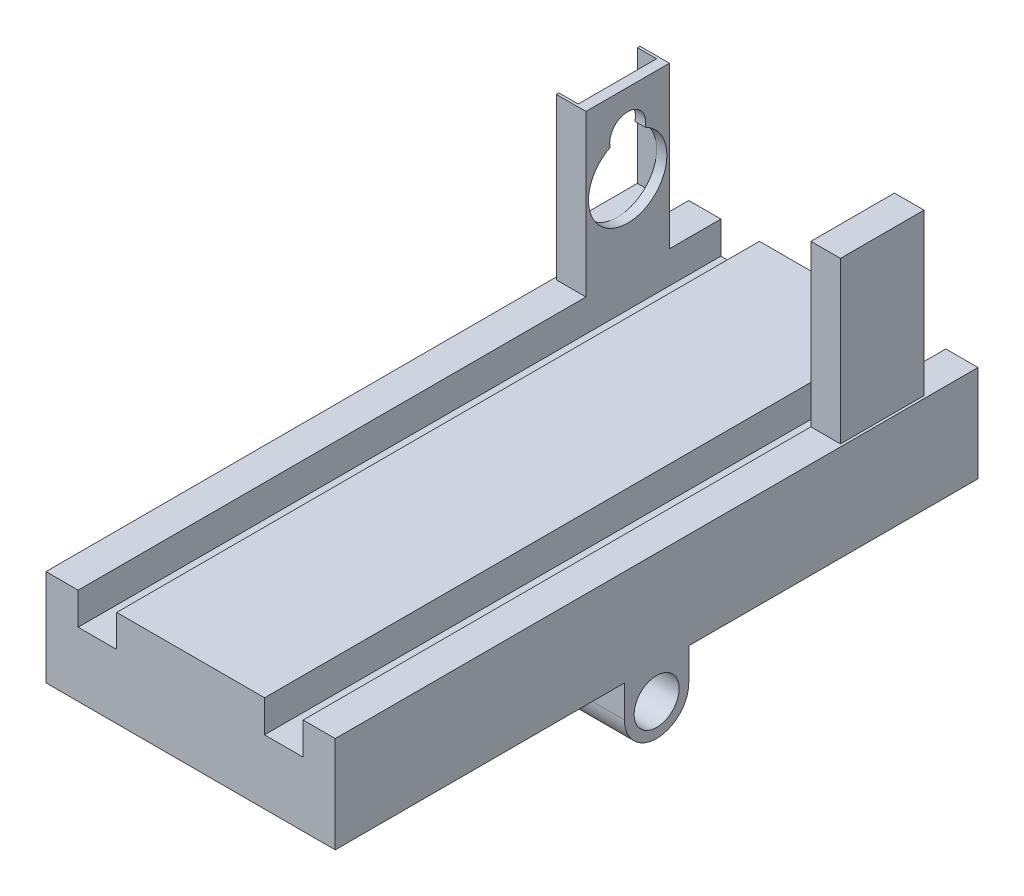
ISO-10303-21;
HEADER;
FILE_DESCRIPTION(('STEP AP214'),'2;1');
FILE_NAME('part.step','',(''),(''),'','','');
FILE_SCHEMA(('AUTOMOTIVE_DESIGN { 1 0 10303 214 1 1 1 1 }'));
ENDSEC;
DATA;
#1=APPLICATION_CONTEXT('core data for automotive mechanical design processes');
#2=APPLICATION_PROTOCOL_DEFINITION('international standard','automotive_design',2000,#1);
#3=PRODUCT_CONTEXT('',#1,'mechanical');
#4=PRODUCT('Part','Part','',(#3));
#5=PRODUCT_RELATED_PRODUCT_CATEGORY('part','',(#4));
#6=PRODUCT_DEFINITION_FORMATION('','',#4);
#7=PRODUCT_DEFINITION_CONTEXT('part definition',#1,'design');
#8=PRODUCT_DEFINITION('design','',#6,#7);
#9=PRODUCT_DEFINITION_SHAPE('','',#8);
#10=(LENGTH_UNIT() NAMED_UNIT(*) SI_UNIT(.MILLI.,.METRE.));
#11=(NAMED_UNIT(*) PLANE_ANGLE_UNIT() SI_UNIT($,.RADIAN.));
#12=(NAMED_UNIT(*) SI_UNIT($,.STERADIAN.) SOLID_ANGLE_UNIT());
#13=UNCERTAINTY_MEASURE_WITH_UNIT(LENGTH_MEASURE(1.E-05),#10,'distance_accuracy_value','');
#14=(GEOMETRIC_REPRESENTATION_CONTEXT(3) GLOBAL_UNCERTAINTY_ASSIGNED_CONTEXT((#13)) GLOBAL_UNIT_ASSIGNED_CONTEXT((#10,
#11,#12)) REPRESENTATION_CONTEXT('',''));
#15=CARTESIAN_POINT('',(0.,0.,0.));
#16=DIRECTION('',(0.,0.,1.));
#17=DIRECTION('',(1.,0.,0.));
#18=AXIS2_PLACEMENT_3D('',#15,#16,#17);
#19=CARTESIAN_POINT('',(-42.5,23.9,14.5));
#20=DIRECTION('',(1.,0.,0.));
#21=DIRECTION('',(0.,0.,-1.));
#22=AXIS2_PLACEMENT_3D('',#19,#20,#21);
#23=CYLINDRICAL_SURFACE('',#22,2.8);
#24=CARTESIAN_POINT('',(-19.1,23.9,14.5));
#25=DIRECTION('',(-1.,0.,0.));
#26=DIRECTION('',(0.,-1.,0.));
#27=AXIS2_PLACEMENT_3D('',#24,#25,#26);
#28=CIRCLE('',#27,2.8);
#29=CARTESIAN_POINT('',(-19.1,23.2573770491803,11.7747411603519));
#30=VERTEX_POINT('',#29);
#31=CARTESIAN_POINT('',(-19.1,23.2573770491803,17.225258839648));
#32=VERTEX_POINT('',#31);
#33=EDGE_CURVE('E302',#30,#32,#28,.F.);
#34=ORIENTED_EDGE('',*,*,#33,.F.);
#35=DIRECTION('',(1.,0.,0.));
#36=VECTOR('',#35,1.);
#37=CARTESIAN_POINT('',(-30.,23.2573770491803,11.7747411603519));
#38=LINE('',#37,#36);
#39=CARTESIAN_POINT('',(-17.5,23.2573770491803,11.7747411603519));
#40=VERTEX_POINT('',#39);
#41=EDGE_CURVE('E327',#30,#40,#38,.T.);
#42=ORIENTED_EDGE('',*,*,#41,.T.);
#43=CARTESIAN_POINT('',(-17.5,23.9,14.5));
#44=DIRECTION('',(1.,0.,0.));
#45=DIRECTION('',(0.,0.,-1.));
#46=AXIS2_PLACEMENT_3D('',#43,#44,#45);
#47=CIRCLE('',#46,2.8);
#48=CARTESIAN_POINT('',(-17.5,23.2573770491803,17.225258839648));
#49=VERTEX_POINT('',#48);
#50=EDGE_CURVE('E317',#40,#49,#47,.T.);
#51=ORIENTED_EDGE('',*,*,#50,.T.);
#52=DIRECTION('',(1.,0.,0.));
#53=VECTOR('',#52,1.);
#54=CARTESIAN_POINT('',(-30.,23.2573770491803,17.225258839648));
#55=LINE('',#54,#53);
#56=EDGE_CURVE('E320',#49,#32,#55,.F.);
#57=ORIENTED_EDGE('',*,*,#56,.T.);
#58=EDGE_LOOP('',(#34,#42,#51,#57));
#59=FACE_BOUND('',#58,.T.);
#60=ADVANCED_FACE('F51',(#59),#23,.F.);
#61=CARTESIAN_POINT('',(-42.5,17.8,14.5));
#62=DIRECTION('',(1.,0.,0.));
#63=DIRECTION('',(0.,0.,-1.));
#64=AXIS2_PLACEMENT_3D('',#61,#62,#63);
#65=CYLINDRICAL_SURFACE('',#64,6.1);
#66=CARTESIAN_POINT('',(-19.1,17.8,14.5));
#67=DIRECTION('',(-1.,0.,0.));
#68=DIRECTION('',(0.,-1.,0.));
#69=AXIS2_PLACEMENT_3D('',#66,#67,#68);
#70=CIRCLE('',#69,6.1);
#71=CARTESIAN_POINT('',(-19.1,17.8,8.4));
#72=VERTEX_POINT('',#71);
#73=EDGE_CURVE('E12',#72,#30,#70,.F.);
#74=ORIENTED_EDGE('',*,*,#73,.F.);
#75=CARTESIAN_POINT('',(-19.1,11.7,14.5));
#76=VERTEX_POINT('',#75);
#77=EDGE_CURVE('E61',#76,#72,#70,.F.);
#78=ORIENTED_EDGE('',*,*,#77,.F.);
#79=CARTESIAN_POINT('',(-19.1,17.8,20.6));
#80=VERTEX_POINT('',#79);
#81=EDGE_CURVE('E55',#80,#76,#70,.F.);
#82=ORIENTED_EDGE('',*,*,#81,.F.);
#83=EDGE_CURVE('E583',#32,#80,#70,.F.);
#84=ORIENTED_EDGE('',*,*,#83,.F.);
#85=ORIENTED_EDGE('',*,*,#56,.F.);
#86=CARTESIAN_POINT('',(-17.5,17.8,14.5));
#87=DIRECTION('',(1.,0.,0.));
#88=DIRECTION('',(0.,0.,-1.));
#89=AXIS2_PLACEMENT_3D('',#86,#87,#88);
#90=CIRCLE('',#89,6.1);
#91=EDGE_CURVE('E316',#49,#40,#90,.T.);
#92=ORIENTED_EDGE('',*,*,#91,.T.);
#93=ORIENTED_EDGE('',*,*,#41,.F.);
#94=EDGE_LOOP('',(#74,#78,#82,#84,#85,#92,#93));
#95=FACE_BOUND('',#94,.T.);
#96=ADVANCED_FACE('F593',(#95),#65,.F.);
#97=CARTESIAN_POINT('',(-17.5,5.,100.));
#98=DIRECTION('',(0.,-1.,0.));
#99=DIRECTION('',(1.,0.,0.));
#100=AXIS2_PLACEMENT_3D('',#97,#98,#99);
#101=PLANE('',#100);
#102=DIRECTION('',(1.,0.,0.));
#103=VECTOR('',#102,1.);
#104=CARTESIAN_POINT('',(-22.1,5.,21.));
#105=LINE('',#104,#103);
#106=CARTESIAN_POINT('',(-22.1,5.,21.));
#107=VERTEX_POINT('',#106);
#108=CARTESIAN_POINT('',(-17.5,5.,21.));
#109=VERTEX_POINT('',#108);
#110=EDGE_CURVE('E350',#107,#109,#105,.T.);
#111=ORIENTED_EDGE('',*,*,#110,.F.);
#112=DIRECTION('',(0.,0.,1.));
#113=VECTOR('',#112,1.);
#114=CARTESIAN_POINT('',(-22.1,5.,8.));
#115=LINE('',#114,#113);
#116=CARTESIAN_POINT('',(-22.1,5.,8.));
#117=VERTEX_POINT('',#116);
#118=EDGE_CURVE('E346',#117,#107,#115,.T.);
#119=ORIENTED_EDGE('',*,*,#118,.F.);
#120=DIRECTION('',(-1.,0.,0.));
#121=VECTOR('',#120,1.);
#122=CARTESIAN_POINT('',(-22.1,5.,8.));
#123=LINE('',#122,#121);
#124=CARTESIAN_POINT('',(-17.5,5.,8.00000000000001));
#125=VERTEX_POINT('',#124);
#126=EDGE_CURVE('E355',#125,#117,#123,.T.);
#127=ORIENTED_EDGE('',*,*,#126,.F.);
#128=DIRECTION('',(0.,0.,-1.));
#129=VECTOR('',#128,1.);
#130=CARTESIAN_POINT('',(-17.5,5.,100.));
#131=LINE('',#130,#129);
#132=CARTESIAN_POINT('',(-17.5,5.,0.));
#133=VERTEX_POINT('',#132);
#134=EDGE_CURVE('E570',#125,#133,#131,.T.);
#135=ORIENTED_EDGE('',*,*,#134,.T.);
#136=DIRECTION('',(-1.,0.,0.));
#137=VECTOR('',#136,1.);
#138=CARTESIAN_POINT('',(-17.5,5.,0.));
#139=LINE('',#138,#137);
#140=CARTESIAN_POINT('',(-22.5,5.,0.));
#141=VERTEX_POINT('',#140);
#142=EDGE_CURVE('E503',#133,#141,#139,.T.);
#143=ORIENTED_EDGE('',*,*,#142,.T.);
#144=DIRECTION('',(0.,0.,-1.));
#145=VECTOR('',#144,1.);
#146=CARTESIAN_POINT('',(-22.5,5.,100.));
#147=LINE('',#146,#145);
#148=CARTESIAN_POINT('',(-22.5,5.,100.));
#149=VERTEX_POINT('',#148);
#150=EDGE_CURVE('E566',#149,#141,#147,.T.);
#151=ORIENTED_EDGE('',*,*,#150,.F.);
#152=DIRECTION('',(-1.,0.,0.));
#153=VECTOR('',#152,1.);
#154=CARTESIAN_POINT('',(-17.5,5.,100.));
#155=LINE('',#154,#153);
#156=CARTESIAN_POINT('',(-17.5,5.,100.));
#157=VERTEX_POINT('',#156);
#158=EDGE_CURVE('E465',#157,#149,#155,.T.);
#159=ORIENTED_EDGE('',*,*,#158,.F.);
#160=EDGE_CURVE('E571',#157,#109,#131,.T.);
#161=ORIENTED_EDGE('',*,*,#160,.T.);
#162=EDGE_LOOP('',(#111,#119,#127,#135,#143,#151,#159,#161));
#163=FACE_BOUND('',#162,.T.);
#164=ADVANCED_FACE('F618',(#163),#101,.F.);
#165=CARTESIAN_POINT('',(22.5,5.,100.));
#166=DIRECTION('',(0.,-1.,0.));
#167=DIRECTION('',(1.,0.,0.));
#168=AXIS2_PLACEMENT_3D('',#165,#166,#167);
#169=PLANE('',#168);
#170=DIRECTION('',(1.,0.,0.));
#171=VECTOR('',#170,1.);
#172=CARTESIAN_POINT('',(17.5,4.99999999999999,21.));
#173=LINE('',#172,#171);
#174=CARTESIAN_POINT('',(17.5,4.99999999999999,21.));
#175=VERTEX_POINT('',#174);
#176=CARTESIAN_POINT('',(22.1,4.99999999999999,21.));
#177=VERTEX_POINT('',#176);
#178=EDGE_CURVE('E351',#175,#177,#173,.T.);
#179=ORIENTED_EDGE('',*,*,#178,.F.);
#180=DIRECTION('',(0.,0.,-1.));
#181=VECTOR('',#180,1.);
#182=CARTESIAN_POINT('',(17.5,5.,100.));
#183=LINE('',#182,#181);
#184=CARTESIAN_POINT('',(17.5,5.,100.));
#185=VERTEX_POINT('',#184);
#186=EDGE_CURVE('E548',#185,#175,#183,.T.);
#187=ORIENTED_EDGE('',*,*,#186,.F.);
#188=DIRECTION('',(-1.,0.,0.));
#189=VECTOR('',#188,1.);
#190=CARTESIAN_POINT('',(22.5,5.,100.));
#191=LINE('',#190,#189);
#192=CARTESIAN_POINT('',(22.5,5.,100.));
#193=VERTEX_POINT('',#192);
#194=EDGE_CURVE('E477',#193,#185,#191,.T.);
#195=ORIENTED_EDGE('',*,*,#194,.F.);
#196=DIRECTION('',(0.,0.,-1.));
#197=VECTOR('',#196,1.);
#198=CARTESIAN_POINT('',(22.5,5.,100.));
#199=LINE('',#198,#197);
#200=CARTESIAN_POINT('',(22.5,5.,0.));
#201=VERTEX_POINT('',#200);
#202=EDGE_CURVE('E552',#193,#201,#199,.T.);
#203=ORIENTED_EDGE('',*,*,#202,.T.);
#204=DIRECTION('',(-1.,0.,0.));
#205=VECTOR('',#204,1.);
#206=CARTESIAN_POINT('',(22.5,5.,0.));
#207=LINE('',#206,#205);
#208=CARTESIAN_POINT('',(17.5,5.,0.));
#209=VERTEX_POINT('',#208);
#210=EDGE_CURVE('E517',#201,#209,#207,.T.);
#211=ORIENTED_EDGE('',*,*,#210,.T.);
#212=CARTESIAN_POINT('',(17.5,5.,8.00000000000001));
#213=VERTEX_POINT('',#212);
#214=EDGE_CURVE('E547',#213,#209,#183,.T.);
#215=ORIENTED_EDGE('',*,*,#214,.F.);
#216=DIRECTION('',(-1.,0.,0.));
#217=VECTOR('',#216,1.);
#218=CARTESIAN_POINT('',(17.5,4.99999999999999,8.00000000000001));
#219=LINE('',#218,#217);
#220=CARTESIAN_POINT('',(22.1,4.99999999999999,8.));
#221=VERTEX_POINT('',#220);
#222=EDGE_CURVE('E389',#221,#213,#219,.T.);
#223=ORIENTED_EDGE('',*,*,#222,.F.);
#224=DIRECTION('',(0.,0.,-1.));
#225=VECTOR('',#224,1.);
#226=CARTESIAN_POINT('',(22.1,4.99999999999999,8.));
#227=LINE('',#226,#225);
#228=EDGE_CURVE('E393',#177,#221,#227,.T.);
#229=ORIENTED_EDGE('',*,*,#228,.F.);
#230=EDGE_LOOP('',(#179,#187,#195,#203,#211,#215,#223,#229));
#231=FACE_BOUND('',#230,.T.);
#232=ADVANCED_FACE('F727',(#231),#169,.F.);
#233=CARTESIAN_POINT('',(-22.5,-10.,100.));
#234=DIRECTION('',(0.,1.,0.));
#235=DIRECTION('',(0.,0.,1.));
#236=AXIS2_PLACEMENT_3D('',#233,#234,#235);
#237=PLANE('',#236);
#238=DIRECTION('',(-1.,0.,0.));
#239=VECTOR('',#238,1.);
#240=CARTESIAN_POINT('',(22.5,-10.,55.));
#241=LINE('',#240,#239);
#242=CARTESIAN_POINT('',(22.5,-10.,55.));
#243=VERTEX_POINT('',#242);
#244=CARTESIAN_POINT('',(-22.5,-10.,55.));
#245=VERTEX_POINT('',#244);
#246=EDGE_CURVE('E448',#243,#245,#241,.T.);
#247=ORIENTED_EDGE('',*,*,#246,.F.);
#248=DIRECTION('',(0.,0.,-1.));
#249=VECTOR('',#248,1.);
#250=CARTESIAN_POINT('',(22.5,-10.,100.));
#251=LINE('',#250,#249);
#252=CARTESIAN_POINT('',(22.5,-10.,100.));
#253=VERTEX_POINT('',#252);
#254=EDGE_CURVE('E557',#253,#243,#251,.T.);
#255=ORIENTED_EDGE('',*,*,#254,.F.);
#256=DIRECTION('',(1.,0.,0.));
#257=VECTOR('',#256,1.);
#258=CARTESIAN_POINT('',(-22.5,-10.,100.));
#259=LINE('',#258,#257);
#260=CARTESIAN_POINT('',(-22.5,-10.,100.));
#261=VERTEX_POINT('',#260);
#262=EDGE_CURVE('E471',#261,#253,#259,.T.);
#263=ORIENTED_EDGE('',*,*,#262,.F.);
#264=DIRECTION('',(0.,0.,-1.));
#265=VECTOR('',#264,1.);
#266=CARTESIAN_POINT('',(-22.5,-10.,100.));
#267=LINE('',#266,#265);
#268=EDGE_CURVE('E562',#261,#245,#267,.T.);
#269=ORIENTED_EDGE('',*,*,#268,.T.);
#270=EDGE_LOOP('',(#247,#255,#263,#269));
#271=FACE_BOUND('',#270,.T.);
#272=ADVANCED_FACE('F730',(#271),#237,.F.);
#273=CARTESIAN_POINT('',(-11.5,5.,100.));
#274=DIRECTION('',(1.,0.,0.));
#275=DIRECTION('',(0.,0.,-1.));
#276=AXIS2_PLACEMENT_3D('',#273,#274,#275);
#277=PLANE('',#276);
#278=DIRECTION('',(0.,-1.,0.));
#279=VECTOR('',#278,1.);
#280=CARTESIAN_POINT('',(-11.5,5.,0.));
#281=LINE('',#280,#279);
#282=CARTESIAN_POINT('',(-11.5,5.,0.));
#283=VERTEX_POINT('',#282);
#284=CARTESIAN_POINT('',(-11.5,0.,0.));
#285=VERTEX_POINT('',#284);
#286=EDGE_CURVE('E443',#283,#285,#281,.T.);
#287=ORIENTED_EDGE('',*,*,#286,.T.);
#288=DIRECTION('',(0.,0.,-1.));
#289=VECTOR('',#288,1.);
#290=CARTESIAN_POINT('',(-11.5,0.,100.));
#291=LINE('',#290,#289);
#292=CARTESIAN_POINT('',(-11.5,0.,100.));
#293=VERTEX_POINT('',#292);
#294=EDGE_CURVE('E577',#293,#285,#291,.T.);
#295=ORIENTED_EDGE('',*,*,#294,.F.);
#296=DIRECTION('',(0.,-1.,0.));
#297=VECTOR('',#296,1.);
#298=CARTESIAN_POINT('',(-11.5,5.,100.));
#299=LINE('',#298,#297);
#300=CARTESIAN_POINT('',(-11.5,5.,100.));
#301=VERTEX_POINT('',#300);
#302=EDGE_CURVE('E454',#301,#293,#299,.T.);
#303=ORIENTED_EDGE('',*,*,#302,.F.);
#304=DIRECTION('',(0.,0.,-1.));
#305=VECTOR('',#304,1.);
#306=CARTESIAN_POINT('',(-11.5,5.,100.));
#307=LINE('',#306,#305);
#308=EDGE_CURVE('E492',#301,#283,#307,.T.);
#309=ORIENTED_EDGE('',*,*,#308,.T.);
#310=EDGE_LOOP('',(#287,#295,#303,#309));
#311=FACE_BOUND('',#310,.T.);
#312=ADVANCED_FACE('F53',(#311),#277,.F.);
#313=CARTESIAN_POINT('',(-11.5,0.,100.));
#314=DIRECTION('',(0.,-1.,0.));
#315=DIRECTION('',(1.,0.,0.));
#316=AXIS2_PLACEMENT_3D('',#313,#314,#315);
#317=PLANE('',#316);
#318=DIRECTION('',(-1.,0.,0.));
#319=VECTOR('',#318,1.);
#320=CARTESIAN_POINT('',(-11.5,0.,0.));
#321=LINE('',#320,#319);
#322=CARTESIAN_POINT('',(-17.5,0.,0.));
#323=VERTEX_POINT('',#322);
#324=EDGE_CURVE('E496',#285,#323,#321,.T.);
#325=ORIENTED_EDGE('',*,*,#324,.T.);
#326=DIRECTION('',(0.,0.,-1.));
#327=VECTOR('',#326,1.);
#328=CARTESIAN_POINT('',(-17.5,0.,100.));
#329=LINE('',#328,#327);
#330=CARTESIAN_POINT('',(-17.5,0.,100.));
#331=VERTEX_POINT('',#330);
#332=EDGE_CURVE('E574',#331,#323,#329,.T.);
#333=ORIENTED_EDGE('',*,*,#332,.F.);
#334=DIRECTION('',(-1.,0.,0.));
#335=VECTOR('',#334,1.);
#336=CARTESIAN_POINT('',(-11.5,0.,100.));
#337=LINE('',#336,#335);
#338=EDGE_CURVE('E458',#293,#331,#337,.T.);
#339=ORIENTED_EDGE('',*,*,#338,.F.);
#340=ORIENTED_EDGE('',*,*,#294,.T.);
#341=EDGE_LOOP('',(#325,#333,#339,#340));
#342=FACE_BOUND('',#341,.T.);
#343=ADVANCED_FACE('F603',(#342),#317,.F.);
#344=CARTESIAN_POINT('',(-17.5,0.,100.));
#345=DIRECTION('',(-1.,0.,0.));
#346=DIRECTION('',(0.,0.,1.));
#347=AXIS2_PLACEMENT_3D('',#344,#345,#346);
#348=PLANE('',#347);
#349=ORIENTED_EDGE('',*,*,#91,.F.);
#350=ORIENTED_EDGE('',*,*,#50,.F.);
#351=EDGE_LOOP('',(#349,#350));
#352=FACE_BOUND('',#351,.T.);
#353=DIRECTION('',(0.,1.,0.));
#354=VECTOR('',#353,1.);
#355=CARTESIAN_POINT('',(-17.5,0.,0.));
#356=LINE('',#355,#354);
#357=EDGE_CURVE('E499',#323,#133,#356,.T.);
#358=ORIENTED_EDGE('',*,*,#357,.T.);
#359=ORIENTED_EDGE('',*,*,#134,.F.);
#360=DIRECTION('',(0.,-1.,0.));
#361=VECTOR('',#360,1.);
#362=CARTESIAN_POINT('',(-17.5,30.,8.));
#363=LINE('',#362,#361);
#364=CARTESIAN_POINT('',(-17.5,30.,8.));
#365=VERTEX_POINT('',#364);
#366=EDGE_CURVE('E362',#365,#125,#363,.T.);
#367=ORIENTED_EDGE('',*,*,#366,.F.);
#368=DIRECTION('',(0.,0.,-1.));
#369=VECTOR('',#368,1.);
#370=CARTESIAN_POINT('',(-17.5,30.,8.));
#371=LINE('',#370,#369);
#372=CARTESIAN_POINT('',(-17.5,30.,21.));
#373=VERTEX_POINT('',#372);
#374=EDGE_CURVE('E339',#373,#365,#371,.T.);
#375=ORIENTED_EDGE('',*,*,#374,.F.);
#376=DIRECTION('',(0.,-1.,0.));
#377=VECTOR('',#376,1.);
#378=CARTESIAN_POINT('',(-17.5,30.,21.));
#379=LINE('',#378,#377);
#380=EDGE_CURVE('E366',#373,#109,#379,.T.);
#381=ORIENTED_EDGE('',*,*,#380,.T.);
#382=ORIENTED_EDGE('',*,*,#160,.F.);
#383=DIRECTION('',(0.,1.,0.));
#384=VECTOR('',#383,1.);
#385=CARTESIAN_POINT('',(-17.5,0.,100.));
#386=LINE('',#385,#384);
#387=EDGE_CURVE('E462',#331,#157,#386,.T.);
#388=ORIENTED_EDGE('',*,*,#387,.F.);
#389=ORIENTED_EDGE('',*,*,#332,.T.);
#390=EDGE_LOOP('',(#358,#359,#367,#375,#381,#382,#388,#389));
#391=FACE_BOUND('',#390,.T.);
#392=ADVANCED_FACE('F599',(#352,#391),#348,.F.);
#393=CARTESIAN_POINT('',(-22.5,5.,100.));
#394=DIRECTION('',(1.,0.,0.));
#395=DIRECTION('',(0.,0.,-1.));
#396=AXIS2_PLACEMENT_3D('',#393,#394,#395);
#397=PLANE('',#396);
#398=CARTESIAN_POINT('',(-22.5,-15.,50.));
#399=DIRECTION('',(-1.,0.,0.));
#400=DIRECTION('',(0.,0.,1.));
#401=AXIS2_PLACEMENT_3D('',#398,#399,#400);
#402=CIRCLE('',#401,3.5);
#403=CARTESIAN_POINT('',(-22.5,-15.,53.5));
#404=VERTEX_POINT('',#403);
#405=EDGE_CURVE('E374',#404,#404,#402,.T.);
#406=ORIENTED_EDGE('',*,*,#405,.F.);
#407=EDGE_LOOP('',(#406));
#408=FACE_BOUND('',#407,.T.);
#409=DIRECTION('',(0.,-1.,0.));
#410=VECTOR('',#409,1.);
#411=CARTESIAN_POINT('',(-22.5,-15.,45.));
#412=LINE('',#411,#410);
#413=CARTESIAN_POINT('',(-22.5,-10.,45.));
#414=VERTEX_POINT('',#413);
#415=CARTESIAN_POINT('',(-22.5,-15.,45.));
#416=VERTEX_POINT('',#415);
#417=EDGE_CURVE('E430',#414,#416,#412,.T.);
#418=ORIENTED_EDGE('',*,*,#417,.T.);
#419=CARTESIAN_POINT('',(-22.5,-15.,50.));
#420=DIRECTION('',(-1.,0.,0.));
#421=DIRECTION('',(0.,0.,1.));
#422=AXIS2_PLACEMENT_3D('',#419,#420,#421);
#423=CIRCLE('',#422,5.);
#424=CARTESIAN_POINT('',(-22.5,-15.,55.));
#425=VERTEX_POINT('',#424);
#426=EDGE_CURVE('E414',#416,#425,#423,.T.);
#427=ORIENTED_EDGE('',*,*,#426,.T.);
#428=DIRECTION('',(0.,1.,0.));
#429=VECTOR('',#428,1.);
#430=CARTESIAN_POINT('',(-22.5,-15.,55.));
#431=LINE('',#430,#429);
#432=EDGE_CURVE('E422',#425,#245,#431,.T.);
#433=ORIENTED_EDGE('',*,*,#432,.T.);
#434=ORIENTED_EDGE('',*,*,#268,.F.);
#435=DIRECTION('',(0.,-1.,0.));
#436=VECTOR('',#435,1.);
#437=CARTESIAN_POINT('',(-22.5,5.,100.));
#438=LINE('',#437,#436);
#439=EDGE_CURVE('E468',#149,#261,#438,.T.);
#440=ORIENTED_EDGE('',*,*,#439,.F.);
#441=ORIENTED_EDGE('',*,*,#150,.T.);
#442=DIRECTION('',(0.,-1.,0.));
#443=VECTOR('',#442,1.);
#444=CARTESIAN_POINT('',(-22.5,5.,0.));
#445=LINE('',#444,#443);
#446=CARTESIAN_POINT('',(-22.5,-10.,0.));
#447=VERTEX_POINT('',#446);
#448=EDGE_CURVE('E506',#141,#447,#445,.T.);
#449=ORIENTED_EDGE('',*,*,#448,.T.);
#450=EDGE_CURVE('E561',#414,#447,#267,.T.);
#451=ORIENTED_EDGE('',*,*,#450,.F.);
#452=EDGE_LOOP('',(#418,#427,#433,#434,#440,#441,#449,#451));
#453=FACE_BOUND('',#452,.T.);
#454=ADVANCED_FACE('F602',(#408,#453),#397,.F.);
#455=CARTESIAN_POINT('',(22.5,-10.,45.));
#456=VERTEX_POINT('',#455);
#457=CARTESIAN_POINT('',(22.5,-10.,0.));
#458=VERTEX_POINT('',#457);
#459=EDGE_CURVE('E556',#456,#458,#251,.T.);
#460=ORIENTED_EDGE('',*,*,#459,.F.);
#461=DIRECTION('',(-1.,0.,0.));
#462=VECTOR('',#461,1.);
#463=CARTESIAN_POINT('',(22.5,-10.,45.));
#464=LINE('',#463,#462);
#465=EDGE_CURVE('E444',#456,#414,#464,.T.);
#466=ORIENTED_EDGE('',*,*,#465,.T.);
#467=ORIENTED_EDGE('',*,*,#450,.T.);
#468=DIRECTION('',(1.,0.,0.));
#469=VECTOR('',#468,1.);
#470=CARTESIAN_POINT('',(-22.5,-10.,0.));
#471=LINE('',#470,#469);
#472=EDGE_CURVE('E510',#447,#458,#471,.T.);
#473=ORIENTED_EDGE('',*,*,#472,.T.);
#474=EDGE_LOOP('',(#460,#466,#467,#473));
#475=FACE_BOUND('',#474,.T.);
#476=ADVANCED_FACE('F734',(#475),#237,.F.);
#477=CARTESIAN_POINT('',(22.5,-10.,100.));
#478=DIRECTION('',(-1.,0.,0.));
#479=DIRECTION('',(0.,-1.,0.));
#480=AXIS2_PLACEMENT_3D('',#477,#478,#479);
#481=PLANE('',#480);
#482=CARTESIAN_POINT('',(22.5,-15.,50.));
#483=DIRECTION('',(-1.,0.,0.));
#484=DIRECTION('',(0.,0.,1.));
#485=AXIS2_PLACEMENT_3D('',#482,#483,#484);
#486=CIRCLE('',#485,3.5);
#487=CARTESIAN_POINT('',(22.5,-15.,53.5));
#488=VERTEX_POINT('',#487);
#489=EDGE_CURVE('E410',#488,#488,#486,.T.);
#490=ORIENTED_EDGE('',*,*,#489,.T.);
#491=EDGE_LOOP('',(#490));
#492=FACE_BOUND('',#491,.T.);
#493=DIRECTION('',(0.,1.,0.));
#494=VECTOR('',#493,1.);
#495=CARTESIAN_POINT('',(22.5,-15.,55.));
#496=LINE('',#495,#494);
#497=CARTESIAN_POINT('',(22.5,-15.,55.));
#498=VERTEX_POINT('',#497);
#499=EDGE_CURVE('E426',#498,#243,#496,.T.);
#500=ORIENTED_EDGE('',*,*,#499,.F.);
#501=CARTESIAN_POINT('',(22.5,-15.,50.));
#502=DIRECTION('',(-1.,0.,0.));
#503=DIRECTION('',(0.,0.,1.));
#504=AXIS2_PLACEMENT_3D('',#501,#502,#503);
#505=CIRCLE('',#504,5.);
#506=CARTESIAN_POINT('',(22.5,-15.,45.));
#507=VERTEX_POINT('',#506);
#508=EDGE_CURVE('E418',#507,#498,#505,.T.);
#509=ORIENTED_EDGE('',*,*,#508,.F.);
#510=DIRECTION('',(0.,-1.,0.));
#511=VECTOR('',#510,1.);
#512=CARTESIAN_POINT('',(22.5,-15.,45.));
#513=LINE('',#512,#511);
#514=EDGE_CURVE('E429',#456,#507,#513,.T.);
#515=ORIENTED_EDGE('',*,*,#514,.F.);
#516=ORIENTED_EDGE('',*,*,#459,.T.);
#517=DIRECTION('',(0.,1.,0.));
#518=VECTOR('',#517,1.);
#519=CARTESIAN_POINT('',(22.5,-10.,0.));
#520=LINE('',#519,#518);
#521=EDGE_CURVE('E514',#458,#201,#520,.T.);
#522=ORIENTED_EDGE('',*,*,#521,.T.);
#523=ORIENTED_EDGE('',*,*,#202,.F.);
#524=DIRECTION('',(0.,1.,0.));
#525=VECTOR('',#524,1.);
#526=CARTESIAN_POINT('',(22.5,-10.,100.));
#527=LINE('',#526,#525);
#528=EDGE_CURVE('E474',#253,#193,#527,.T.);
#529=ORIENTED_EDGE('',*,*,#528,.F.);
#530=ORIENTED_EDGE('',*,*,#254,.T.);
#531=EDGE_LOOP('',(#500,#509,#515,#516,#522,#523,#529,#530));
#532=FACE_BOUND('',#531,.T.);
#533=ADVANCED_FACE('F725',(#492,#532),#481,.F.);
#534=CARTESIAN_POINT('',(17.5,5.,100.));
#535=DIRECTION('',(1.,0.,0.));
#536=DIRECTION('',(0.,0.,-1.));
#537=AXIS2_PLACEMENT_3D('',#534,#535,#536);
#538=PLANE('',#537);
#539=DIRECTION('',(0.,-1.,0.));
#540=VECTOR('',#539,1.);
#541=CARTESIAN_POINT('',(17.5,5.,0.));
#542=LINE('',#541,#540);
#543=CARTESIAN_POINT('',(17.5,0.,0.));
#544=VERTEX_POINT('',#543);
#545=EDGE_CURVE('E521',#209,#544,#542,.T.);
#546=ORIENTED_EDGE('',*,*,#545,.T.);
#547=DIRECTION('',(0.,0.,-1.));
#548=VECTOR('',#547,1.);
#549=CARTESIAN_POINT('',(17.5,0.,100.));
#550=LINE('',#549,#548);
#551=CARTESIAN_POINT('',(17.5,0.,100.));
#552=VERTEX_POINT('',#551);
#553=EDGE_CURVE('E543',#552,#544,#550,.T.);
#554=ORIENTED_EDGE('',*,*,#553,.F.);
#555=DIRECTION('',(0.,-1.,0.));
#556=VECTOR('',#555,1.);
#557=CARTESIAN_POINT('',(17.5,5.,100.));
#558=LINE('',#557,#556);
#559=EDGE_CURVE('E480',#185,#552,#558,.T.);
#560=ORIENTED_EDGE('',*,*,#559,.F.);
#561=ORIENTED_EDGE('',*,*,#186,.T.);
#562=DIRECTION('',(0.,-1.,0.));
#563=VECTOR('',#562,1.);
#564=CARTESIAN_POINT('',(17.5,30.,21.));
#565=LINE('',#564,#563);
#566=CARTESIAN_POINT('',(17.5,30.,21.));
#567=VERTEX_POINT('',#566);
#568=EDGE_CURVE('E330',#567,#175,#565,.T.);
#569=ORIENTED_EDGE('',*,*,#568,.F.);
#570=DIRECTION('',(0.,0.,1.));
#571=VECTOR('',#570,1.);
#572=CARTESIAN_POINT('',(17.5,30.,8.00000000000001));
#573=LINE('',#572,#571);
#574=CARTESIAN_POINT('',(17.5,30.,8.00000000000001));
#575=VERTEX_POINT('',#574);
#576=EDGE_CURVE('E394',#575,#567,#573,.T.);
#577=ORIENTED_EDGE('',*,*,#576,.F.);
#578=DIRECTION('',(0.,-1.,0.));
#579=VECTOR('',#578,1.);
#580=CARTESIAN_POINT('',(17.5,30.,8.00000000000001));
#581=LINE('',#580,#579);
#582=EDGE_CURVE('E385',#575,#213,#581,.T.);
#583=ORIENTED_EDGE('',*,*,#582,.T.);
#584=ORIENTED_EDGE('',*,*,#214,.T.);
#585=EDGE_LOOP('',(#546,#554,#560,#561,#569,#577,#583,#584));
#586=FACE_BOUND('',#585,.T.);
#587=ADVANCED_FACE('F721',(#586),#538,.F.);
#588=CARTESIAN_POINT('',(11.5,0.,100.));
#589=DIRECTION('',(0.,-1.,0.));
#590=DIRECTION('',(0.,0.,-1.));
#591=AXIS2_PLACEMENT_3D('',#588,#589,#590);
#592=PLANE('',#591);
#593=DIRECTION('',(-1.,0.,0.));
#594=VECTOR('',#593,1.);
#595=CARTESIAN_POINT('',(11.5,0.,0.));
#596=LINE('',#595,#594);
#597=CARTESIAN_POINT('',(11.5,0.,0.));
#598=VERTEX_POINT('',#597);
#599=EDGE_CURVE('E524',#544,#598,#596,.T.);
#600=ORIENTED_EDGE('',*,*,#599,.T.);
#601=DIRECTION('',(0.,0.,-1.));
#602=VECTOR('',#601,1.);
#603=CARTESIAN_POINT('',(11.5,0.,100.));
#604=LINE('',#603,#602);
#605=CARTESIAN_POINT('',(11.5,0.,100.));
#606=VERTEX_POINT('',#605);
#607=EDGE_CURVE('E539',#606,#598,#604,.T.);
#608=ORIENTED_EDGE('',*,*,#607,.F.);
#609=DIRECTION('',(-1.,0.,0.));
#610=VECTOR('',#609,1.);
#611=CARTESIAN_POINT('',(11.5,0.,100.));
#612=LINE('',#611,#610);
#613=EDGE_CURVE('E483',#552,#606,#612,.T.);
#614=ORIENTED_EDGE('',*,*,#613,.F.);
#615=ORIENTED_EDGE('',*,*,#553,.T.);
#616=EDGE_LOOP('',(#600,#608,#614,#615));
#617=FACE_BOUND('',#616,.T.);
#618=ADVANCED_FACE('F717',(#617),#592,.F.);
#619=CARTESIAN_POINT('',(11.5,5.,100.));
#620=DIRECTION('',(-1.,0.,0.));
#621=DIRECTION('',(0.,0.,1.));
#622=AXIS2_PLACEMENT_3D('',#619,#620,#621);
#623=PLANE('',#622);
#624=DIRECTION('',(0.,1.,0.));
#625=VECTOR('',#624,1.);
#626=CARTESIAN_POINT('',(11.5,5.,0.));
#627=LINE('',#626,#625);
#628=CARTESIAN_POINT('',(11.5,5.,0.));
#629=VERTEX_POINT('',#628);
#630=EDGE_CURVE('E527',#598,#629,#627,.T.);
#631=ORIENTED_EDGE('',*,*,#630,.T.);
#632=DIRECTION('',(0.,0.,-1.));
#633=VECTOR('',#632,1.);
#634=CARTESIAN_POINT('',(11.5,5.,100.));
#635=LINE('',#634,#633);
#636=CARTESIAN_POINT('',(11.5,5.,100.));
#637=VERTEX_POINT('',#636);
#638=EDGE_CURVE('E535',#637,#629,#635,.T.);
#639=ORIENTED_EDGE('',*,*,#638,.F.);
#640=DIRECTION('',(0.,1.,0.));
#641=VECTOR('',#640,1.);
#642=CARTESIAN_POINT('',(11.5,5.,100.));
#643=LINE('',#642,#641);
#644=EDGE_CURVE('E486',#606,#637,#643,.T.);
#645=ORIENTED_EDGE('',*,*,#644,.F.);
#646=ORIENTED_EDGE('',*,*,#607,.T.);
#647=EDGE_LOOP('',(#631,#639,#645,#646));
#648=FACE_BOUND('',#647,.T.);
#649=ADVANCED_FACE('F713',(#648),#623,.F.);
#650=CARTESIAN_POINT('',(-11.5,5.,100.));
#651=DIRECTION('',(0.,-1.,0.));
#652=DIRECTION('',(0.,0.,-1.));
#653=AXIS2_PLACEMENT_3D('',#650,#651,#652);
#654=PLANE('',#653);
#655=DIRECTION('',(-1.,0.,0.));
#656=VECTOR('',#655,1.);
#657=CARTESIAN_POINT('',(-11.5,5.,0.));
#658=LINE('',#657,#656);
#659=EDGE_CURVE('E459',#629,#283,#658,.T.);
#660=ORIENTED_EDGE('',*,*,#659,.T.);
#661=ORIENTED_EDGE('',*,*,#308,.F.);
#662=DIRECTION('',(-1.,0.,0.));
#663=VECTOR('',#662,1.);
#664=CARTESIAN_POINT('',(-11.5,5.,100.));
#665=LINE('',#664,#663);
#666=EDGE_CURVE('E489',#637,#301,#665,.T.);
#667=ORIENTED_EDGE('',*,*,#666,.F.);
#668=ORIENTED_EDGE('',*,*,#638,.T.);
#669=EDGE_LOOP('',(#660,#661,#667,#668));
#670=FACE_BOUND('',#669,.T.);
#671=ADVANCED_FACE('F708',(#670),#654,.F.);
#672=CARTESIAN_POINT('',(0.,0.,100.));
#673=DIRECTION('',(0.,0.,-1.));
#674=DIRECTION('',(-1.,0.,0.));
#675=AXIS2_PLACEMENT_3D('',#672,#673,#674);
#676=PLANE('',#675);
#677=ORIENTED_EDGE('',*,*,#302,.T.);
#678=ORIENTED_EDGE('',*,*,#338,.T.);
#679=ORIENTED_EDGE('',*,*,#387,.T.);
#680=ORIENTED_EDGE('',*,*,#158,.T.);
#681=ORIENTED_EDGE('',*,*,#439,.T.);
#682=ORIENTED_EDGE('',*,*,#262,.T.);
#683=ORIENTED_EDGE('',*,*,#528,.T.);
#684=ORIENTED_EDGE('',*,*,#194,.T.);
#685=ORIENTED_EDGE('',*,*,#559,.T.);
#686=ORIENTED_EDGE('',*,*,#613,.T.);
#687=ORIENTED_EDGE('',*,*,#644,.T.);
#688=ORIENTED_EDGE('',*,*,#666,.T.);
#689=EDGE_LOOP('',(#677,#678,#679,#680,#681,#682,#683,#684,#685,#686,#687,#688));
#690=FACE_BOUND('',#689,.T.);
#691=ADVANCED_FACE('F626',(#690),#676,.F.);
#692=CARTESIAN_POINT('',(0.,0.,0.));
#693=DIRECTION('',(0.,0.,-1.));
#694=DIRECTION('',(-1.,0.,0.));
#695=AXIS2_PLACEMENT_3D('',#692,#693,#694);
#696=PLANE('',#695);
#697=ORIENTED_EDGE('',*,*,#286,.F.);
#698=ORIENTED_EDGE('',*,*,#659,.F.);
#699=ORIENTED_EDGE('',*,*,#630,.F.);
#700=ORIENTED_EDGE('',*,*,#599,.F.);
#701=ORIENTED_EDGE('',*,*,#545,.F.);
#702=ORIENTED_EDGE('',*,*,#210,.F.);
#703=ORIENTED_EDGE('',*,*,#521,.F.);
#704=ORIENTED_EDGE('',*,*,#472,.F.);
#705=ORIENTED_EDGE('',*,*,#448,.F.);
#706=ORIENTED_EDGE('',*,*,#142,.F.);
#707=ORIENTED_EDGE('',*,*,#357,.F.);
#708=ORIENTED_EDGE('',*,*,#324,.F.);
#709=EDGE_LOOP('',(#697,#698,#699,#700,#701,#702,#703,#704,#705,#706,#707,#708));
#710=FACE_BOUND('',#709,.T.);
#711=ADVANCED_FACE('F614',(#710),#696,.T.);
#712=CARTESIAN_POINT('',(22.5,-15.,45.));
#713=DIRECTION('',(0.,0.,-1.));
#714=DIRECTION('',(-1.,0.,0.));
#715=AXIS2_PLACEMENT_3D('',#712,#713,#714);
#716=PLANE('',#715);
#717=ORIENTED_EDGE('',*,*,#417,.F.);
#718=ORIENTED_EDGE('',*,*,#465,.F.);
#719=ORIENTED_EDGE('',*,*,#514,.T.);
#720=DIRECTION('',(-1.,0.,0.));
#721=VECTOR('',#720,1.);
#722=CARTESIAN_POINT('',(22.5,-15.,45.));
#723=LINE('',#722,#721);
#724=EDGE_CURVE('E440',#507,#416,#723,.T.);
#725=ORIENTED_EDGE('',*,*,#724,.T.);
#726=EDGE_LOOP('',(#717,#718,#719,#725));
#727=FACE_BOUND('',#726,.T.);
#728=ADVANCED_FACE('F699',(#727),#716,.T.);
#729=CARTESIAN_POINT('',(22.5,-15.,55.));
#730=DIRECTION('',(0.,0.,1.));
#731=DIRECTION('',(1.,0.,0.));
#732=AXIS2_PLACEMENT_3D('',#729,#730,#731);
#733=PLANE('',#732);
#734=ORIENTED_EDGE('',*,*,#432,.F.);
#735=DIRECTION('',(-1.,0.,0.));
#736=VECTOR('',#735,1.);
#737=CARTESIAN_POINT('',(22.5,-15.,55.));
#738=LINE('',#737,#736);
#739=EDGE_CURVE('E433',#498,#425,#738,.T.);
#740=ORIENTED_EDGE('',*,*,#739,.F.);
#741=ORIENTED_EDGE('',*,*,#499,.T.);
#742=ORIENTED_EDGE('',*,*,#246,.T.);
#743=EDGE_LOOP('',(#734,#740,#741,#742));
#744=FACE_BOUND('',#743,.T.);
#745=ADVANCED_FACE('F697',(#744),#733,.T.);
#746=CARTESIAN_POINT('',(22.5,-15.,50.));
#747=DIRECTION('',(-1.,0.,0.));
#748=DIRECTION('',(0.,0.,1.));
#749=AXIS2_PLACEMENT_3D('',#746,#747,#748);
#750=CYLINDRICAL_SURFACE('',#749,5.);
#751=ORIENTED_EDGE('',*,*,#724,.F.);
#752=ORIENTED_EDGE('',*,*,#508,.T.);
#753=ORIENTED_EDGE('',*,*,#739,.T.);
#754=ORIENTED_EDGE('',*,*,#426,.F.);
#755=EDGE_LOOP('',(#751,#752,#753,#754));
#756=FACE_BOUND('',#755,.T.);
#757=ADVANCED_FACE('F693',(#756),#750,.T.);
#758=CARTESIAN_POINT('',(22.5,-15.,50.));
#759=DIRECTION('',(-1.,0.,0.));
#760=DIRECTION('',(0.,0.,1.));
#761=AXIS2_PLACEMENT_3D('',#758,#759,#760);
#762=CYLINDRICAL_SURFACE('',#761,3.5);
#763=ORIENTED_EDGE('',*,*,#489,.F.);
#764=EDGE_LOOP('',(#763));
#765=FACE_BOUND('',#764,.T.);
#766=ORIENTED_EDGE('',*,*,#405,.T.);
#767=EDGE_LOOP('',(#766));
#768=FACE_BOUND('',#767,.T.);
#769=ADVANCED_FACE('F679',(#765,#768),#762,.F.);
#770=CARTESIAN_POINT('',(17.5,30.,21.));
#771=DIRECTION('',(0.,0.,-1.));
#772=DIRECTION('',(-1.,0.,0.));
#773=AXIS2_PLACEMENT_3D('',#770,#771,#772);
#774=PLANE('',#773);
#775=ORIENTED_EDGE('',*,*,#178,.T.);
#776=DIRECTION('',(0.,-1.,0.));
#777=VECTOR('',#776,1.);
#778=CARTESIAN_POINT('',(22.1,30.,21.));
#779=LINE('',#778,#777);
#780=CARTESIAN_POINT('',(22.1,30.,21.));
#781=VERTEX_POINT('',#780);
#782=EDGE_CURVE('E377',#781,#177,#779,.T.);
#783=ORIENTED_EDGE('',*,*,#782,.F.);
#784=DIRECTION('',(1.,0.,0.));
#785=VECTOR('',#784,1.);
#786=CARTESIAN_POINT('',(17.5,30.,21.));
#787=LINE('',#786,#785);
#788=EDGE_CURVE('E404',#567,#781,#787,.T.);
#789=ORIENTED_EDGE('',*,*,#788,.F.);
#790=ORIENTED_EDGE('',*,*,#568,.T.);
#791=EDGE_LOOP('',(#775,#783,#789,#790));
#792=FACE_BOUND('',#791,.T.);
#793=ADVANCED_FACE('F675',(#792),#774,.F.);
#794=CARTESIAN_POINT('',(22.1,30.,8.));
#795=DIRECTION('',(-1.,0.,0.));
#796=DIRECTION('',(0.,-1.,0.));
#797=AXIS2_PLACEMENT_3D('',#794,#795,#796);
#798=PLANE('',#797);
#799=ORIENTED_EDGE('',*,*,#228,.T.);
#800=DIRECTION('',(0.,-1.,0.));
#801=VECTOR('',#800,1.);
#802=CARTESIAN_POINT('',(22.1,30.,8.));
#803=LINE('',#802,#801);
#804=CARTESIAN_POINT('',(22.1,30.,8.));
#805=VERTEX_POINT('',#804);
#806=EDGE_CURVE('E381',#805,#221,#803,.T.);
#807=ORIENTED_EDGE('',*,*,#806,.F.);
#808=DIRECTION('',(0.,0.,-1.));
#809=VECTOR('',#808,1.);
#810=CARTESIAN_POINT('',(22.1,30.,8.));
#811=LINE('',#810,#809);
#812=EDGE_CURVE('E401',#781,#805,#811,.T.);
#813=ORIENTED_EDGE('',*,*,#812,.F.);
#814=ORIENTED_EDGE('',*,*,#782,.T.);
#815=EDGE_LOOP('',(#799,#807,#813,#814));
#816=FACE_BOUND('',#815,.T.);
#817=ADVANCED_FACE('F678',(#816),#798,.F.);
#818=CARTESIAN_POINT('',(17.5,30.,8.00000000000001));
#819=DIRECTION('',(0.,0.,1.));
#820=DIRECTION('',(1.,0.,0.));
#821=AXIS2_PLACEMENT_3D('',#818,#819,#820);
#822=PLANE('',#821);
#823=ORIENTED_EDGE('',*,*,#222,.T.);
#824=ORIENTED_EDGE('',*,*,#582,.F.);
#825=DIRECTION('',(-1.,0.,0.));
#826=VECTOR('',#825,1.);
#827=CARTESIAN_POINT('',(17.5,30.,8.00000000000001));
#828=LINE('',#827,#826);
#829=EDGE_CURVE('E388',#805,#575,#828,.T.);
#830=ORIENTED_EDGE('',*,*,#829,.F.);
#831=ORIENTED_EDGE('',*,*,#806,.T.);
#832=EDGE_LOOP('',(#823,#824,#830,#831));
#833=FACE_BOUND('',#832,.T.);
#834=ADVANCED_FACE('F683',(#833),#822,.F.);
#835=CARTESIAN_POINT('',(0.,30.,0.));
#836=DIRECTION('',(0.,1.,0.));
#837=DIRECTION('',(-1.,0.,0.));
#838=AXIS2_PLACEMENT_3D('',#835,#836,#837);
#839=PLANE('',#838);
#840=ORIENTED_EDGE('',*,*,#576,.T.);
#841=ORIENTED_EDGE('',*,*,#788,.T.);
#842=ORIENTED_EDGE('',*,*,#812,.T.);
#843=ORIENTED_EDGE('',*,*,#829,.T.);
#844=EDGE_LOOP('',(#840,#841,#842,#843));
#845=FACE_BOUND('',#844,.T.);
#846=ADVANCED_FACE('F674',(#845),#839,.T.);
#847=CARTESIAN_POINT('',(-22.1,30.,8.));
#848=DIRECTION('',(1.,0.,0.));
#849=DIRECTION('',(0.,1.,0.));
#850=AXIS2_PLACEMENT_3D('',#847,#848,#849);
#851=PLANE('',#850);
#852=DIRECTION('',(0.,0.,1.));
#853=VECTOR('',#852,1.);
#854=CARTESIAN_POINT('',(-22.1,11.7,8.4));
#855=LINE('',#854,#853);
#856=CARTESIAN_POINT('',(-22.1,11.7,8.4));
#857=VERTEX_POINT('',#856);
#858=CARTESIAN_POINT('',(-22.1,11.7,20.6));
#859=VERTEX_POINT('',#858);
#860=EDGE_CURVE('E295',#857,#859,#855,.T.);
#861=ORIENTED_EDGE('',*,*,#860,.F.);
#862=DIRECTION('',(0.,-1.,0.));
#863=VECTOR('',#862,1.);
#864=CARTESIAN_POINT('',(-22.1,34.2,8.4));
#865=LINE('',#864,#863);
#866=CARTESIAN_POINT('',(-22.1,30.,8.4));
#867=VERTEX_POINT('',#866);
#868=EDGE_CURVE('E275',#867,#857,#865,.T.);
#869=ORIENTED_EDGE('',*,*,#868,.F.);
#870=DIRECTION('',(0.,0.,1.));
#871=VECTOR('',#870,1.);
#872=CARTESIAN_POINT('',(-22.1,30.,8.));
#873=LINE('',#872,#871);
#874=CARTESIAN_POINT('',(-22.1,30.,8.));
#875=VERTEX_POINT('',#874);
#876=EDGE_CURVE('E331',#875,#867,#873,.T.);
#877=ORIENTED_EDGE('',*,*,#876,.F.);
#878=DIRECTION('',(0.,-1.,0.));
#879=VECTOR('',#878,1.);
#880=CARTESIAN_POINT('',(-22.1,30.,8.));
#881=LINE('',#880,#879);
#882=EDGE_CURVE('E345',#875,#117,#881,.T.);
#883=ORIENTED_EDGE('',*,*,#882,.T.);
#884=ORIENTED_EDGE('',*,*,#118,.T.);
#885=DIRECTION('',(0.,-1.,0.));
#886=VECTOR('',#885,1.);
#887=CARTESIAN_POINT('',(-22.1,30.,21.));
#888=LINE('',#887,#886);
#889=CARTESIAN_POINT('',(-22.1,30.,21.));
#890=VERTEX_POINT('',#889);
#891=EDGE_CURVE('E370',#890,#107,#888,.T.);
#892=ORIENTED_EDGE('',*,*,#891,.F.);
#893=CARTESIAN_POINT('',(-22.1,30.,20.6));
#894=VERTEX_POINT('',#893);
#895=EDGE_CURVE('E336',#894,#890,#873,.T.);
#896=ORIENTED_EDGE('',*,*,#895,.F.);
#897=DIRECTION('',(0.,1.,0.));
#898=VECTOR('',#897,1.);
#899=CARTESIAN_POINT('',(-22.1,34.2,20.6));
#900=LINE('',#899,#898);
#901=EDGE_CURVE('E269',#859,#894,#900,.T.);
#902=ORIENTED_EDGE('',*,*,#901,.F.);
#903=EDGE_LOOP('',(#861,#869,#877,#883,#884,#892,#896,#902));
#904=FACE_BOUND('',#903,.T.);
#905=ADVANCED_FACE('F643',(#904),#851,.F.);
#906=CARTESIAN_POINT('',(-22.1,30.,21.));
#907=DIRECTION('',(0.,0.,-1.));
#908=DIRECTION('',(-1.,0.,0.));
#909=AXIS2_PLACEMENT_3D('',#906,#907,#908);
#910=PLANE('',#909);
#911=ORIENTED_EDGE('',*,*,#110,.T.);
#912=ORIENTED_EDGE('',*,*,#380,.F.);
#913=DIRECTION('',(1.,0.,0.));
#914=VECTOR('',#913,1.);
#915=CARTESIAN_POINT('',(-22.1,30.,21.));
#916=LINE('',#915,#914);
#917=EDGE_CURVE('E335',#890,#373,#916,.T.);
#918=ORIENTED_EDGE('',*,*,#917,.F.);
#919=ORIENTED_EDGE('',*,*,#891,.T.);
#920=EDGE_LOOP('',(#911,#912,#918,#919));
#921=FACE_BOUND('',#920,.T.);
#922=ADVANCED_FACE('F631',(#921),#910,.F.);
#923=CARTESIAN_POINT('',(-22.1,30.,8.));
#924=DIRECTION('',(0.,0.,1.));
#925=DIRECTION('',(1.,0.,0.));
#926=AXIS2_PLACEMENT_3D('',#923,#924,#925);
#927=PLANE('',#926);
#928=ORIENTED_EDGE('',*,*,#126,.T.);
#929=ORIENTED_EDGE('',*,*,#882,.F.);
#930=DIRECTION('',(-1.,0.,0.));
#931=VECTOR('',#930,1.);
#932=CARTESIAN_POINT('',(-22.1,30.,8.));
#933=LINE('',#932,#931);
#934=EDGE_CURVE('E342',#365,#875,#933,.T.);
#935=ORIENTED_EDGE('',*,*,#934,.F.);
#936=ORIENTED_EDGE('',*,*,#366,.T.);
#937=EDGE_LOOP('',(#928,#929,#935,#936));
#938=FACE_BOUND('',#937,.T.);
#939=ADVANCED_FACE('F646',(#938),#927,.F.);
#940=CARTESIAN_POINT('',(0.,30.,0.));
#941=DIRECTION('',(0.,1.,0.));
#942=DIRECTION('',(-1.,0.,0.));
#943=AXIS2_PLACEMENT_3D('',#940,#941,#942);
#944=PLANE('',#943);
#945=DIRECTION('',(-1.,0.,0.));
#946=VECTOR('',#945,1.);
#947=CARTESIAN_POINT('',(0.,30.,8.4));
#948=LINE('',#947,#946);
#949=CARTESIAN_POINT('',(-19.1,30.,8.4));
#950=VERTEX_POINT('',#949);
#951=EDGE_CURVE('E313',#950,#867,#948,.T.);
#952=ORIENTED_EDGE('',*,*,#951,.F.);
#953=DIRECTION('',(0.,0.,1.));
#954=VECTOR('',#953,1.);
#955=CARTESIAN_POINT('',(-19.1,30.,0.));
#956=LINE('',#955,#954);
#957=CARTESIAN_POINT('',(-19.1,30.,20.6));
#958=VERTEX_POINT('',#957);
#959=EDGE_CURVE('E306',#950,#958,#956,.T.);
#960=ORIENTED_EDGE('',*,*,#959,.T.);
#961=DIRECTION('',(1.,0.,0.));
#962=VECTOR('',#961,1.);
#963=CARTESIAN_POINT('',(0.,30.,20.6));
#964=LINE('',#963,#962);
#965=EDGE_CURVE('E310',#894,#958,#964,.T.);
#966=ORIENTED_EDGE('',*,*,#965,.F.);
#967=ORIENTED_EDGE('',*,*,#895,.T.);
#968=ORIENTED_EDGE('',*,*,#917,.T.);
#969=ORIENTED_EDGE('',*,*,#374,.T.);
#970=ORIENTED_EDGE('',*,*,#934,.T.);
#971=ORIENTED_EDGE('',*,*,#876,.T.);
#972=EDGE_LOOP('',(#952,#960,#966,#967,#968,#969,#970,#971));
#973=FACE_BOUND('',#972,.T.);
#974=ADVANCED_FACE('F638',(#973),#944,.T.);
#975=CARTESIAN_POINT('',(-19.1,34.2,8.4));
#976=DIRECTION('',(0.,0.,-1.));
#977=DIRECTION('',(0.,1.,0.));
#978=AXIS2_PLACEMENT_3D('',#975,#976,#977);
#979=PLANE('',#978);
#980=ORIENTED_EDGE('',*,*,#951,.T.);
#981=ORIENTED_EDGE('',*,*,#868,.T.);
#982=DIRECTION('',(-1.,0.,0.));
#983=VECTOR('',#982,1.);
#984=CARTESIAN_POINT('',(-19.1,11.7,8.4));
#985=LINE('',#984,#983);
#986=CARTESIAN_POINT('',(-19.1,11.7,8.4));
#987=VERTEX_POINT('',#986);
#988=EDGE_CURVE('E272',#987,#857,#985,.T.);
#989=ORIENTED_EDGE('',*,*,#988,.F.);
#990=DIRECTION('',(0.,-1.,0.));
#991=VECTOR('',#990,1.);
#992=CARTESIAN_POINT('',(-19.1,34.2,8.4));
#993=LINE('',#992,#991);
#994=EDGE_CURVE('E258',#72,#987,#993,.T.);
#995=ORIENTED_EDGE('',*,*,#994,.F.);
#996=EDGE_CURVE('E268',#950,#72,#993,.T.);
#997=ORIENTED_EDGE('',*,*,#996,.F.);
#998=EDGE_LOOP('',(#980,#981,#989,#995,#997));
#999=FACE_BOUND('',#998,.T.);
#1000=ADVANCED_FACE('F273',(#999),#979,.F.);
#1001=CARTESIAN_POINT('',(-19.1,34.2,20.6));
#1002=DIRECTION('',(0.,0.,1.));
#1003=DIRECTION('',(0.,-1.,0.));
#1004=AXIS2_PLACEMENT_3D('',#1001,#1002,#1003);
#1005=PLANE('',#1004);
#1006=DIRECTION('',(0.,1.,0.));
#1007=VECTOR('',#1006,1.);
#1008=CARTESIAN_POINT('',(-19.1,34.2,20.6));
#1009=LINE('',#1008,#1007);
#1010=CARTESIAN_POINT('',(-19.1,11.7,20.6));
#1011=VERTEX_POINT('',#1010);
#1012=EDGE_CURVE('E76',#1011,#80,#1009,.T.);
#1013=ORIENTED_EDGE('',*,*,#1012,.F.);
#1014=DIRECTION('',(-1.,0.,0.));
#1015=VECTOR('',#1014,1.);
#1016=CARTESIAN_POINT('',(-19.1,11.7,20.6));
#1017=LINE('',#1016,#1015);
#1018=EDGE_CURVE('E280',#1011,#859,#1017,.T.);
#1019=ORIENTED_EDGE('',*,*,#1018,.T.);
#1020=ORIENTED_EDGE('',*,*,#901,.T.);
#1021=ORIENTED_EDGE('',*,*,#965,.T.);
#1022=EDGE_CURVE('E68',#80,#958,#1009,.T.);
#1023=ORIENTED_EDGE('',*,*,#1022,.F.);
#1024=EDGE_LOOP('',(#1013,#1019,#1020,#1021,#1023));
#1025=FACE_BOUND('',#1024,.T.);
#1026=ADVANCED_FACE('F649',(#1025),#1005,.F.);
#1027=CARTESIAN_POINT('',(-19.1,11.7,8.4));
#1028=DIRECTION('',(0.,-1.,0.));
#1029=DIRECTION('',(1.,0.,0.));
#1030=AXIS2_PLACEMENT_3D('',#1027,#1028,#1029);
#1031=PLANE('',#1030);
#1032=DIRECTION('',(0.,0.,1.));
#1033=VECTOR('',#1032,1.);
#1034=CARTESIAN_POINT('',(-19.1,11.7,8.4));
#1035=LINE('',#1034,#1033);
#1036=EDGE_CURVE('E262',#987,#76,#1035,.T.);
#1037=ORIENTED_EDGE('',*,*,#1036,.F.);
#1038=ORIENTED_EDGE('',*,*,#988,.T.);
#1039=ORIENTED_EDGE('',*,*,#860,.T.);
#1040=ORIENTED_EDGE('',*,*,#1018,.F.);
#1041=EDGE_CURVE('E285',#76,#1011,#1035,.T.);
#1042=ORIENTED_EDGE('',*,*,#1041,.F.);
#1043=EDGE_LOOP('',(#1037,#1038,#1039,#1040,#1042));
#1044=FACE_BOUND('',#1043,.T.);
#1045=ADVANCED_FACE('F283',(#1044),#1031,.F.);
#1046=CARTESIAN_POINT('',(-19.1,0.,0.));
#1047=DIRECTION('',(-1.,0.,0.));
#1048=DIRECTION('',(0.,-1.,0.));
#1049=AXIS2_PLACEMENT_3D('',#1046,#1047,#1048);
#1050=PLANE('',#1049);
#1051=ORIENTED_EDGE('',*,*,#996,.T.);
#1052=ORIENTED_EDGE('',*,*,#73,.T.);
#1053=ORIENTED_EDGE('',*,*,#33,.T.);
#1054=ORIENTED_EDGE('',*,*,#83,.T.);
#1055=ORIENTED_EDGE('',*,*,#1022,.T.);
#1056=ORIENTED_EDGE('',*,*,#959,.F.);
#1057=EDGE_LOOP('',(#1051,#1052,#1053,#1054,#1055,#1056));
#1058=FACE_BOUND('',#1057,.T.);
#1059=ADVANCED_FACE('F588',(#1058),#1050,.T.);
#1060=ORIENTED_EDGE('',*,*,#77,.T.);
#1061=ORIENTED_EDGE('',*,*,#994,.T.);
#1062=ORIENTED_EDGE('',*,*,#1036,.T.);
#1063=EDGE_LOOP('',(#1060,#1061,#1062));
#1064=FACE_BOUND('',#1063,.T.);
#1065=ADVANCED_FACE('F260',(#1064),#1050,.T.);
#1066=ORIENTED_EDGE('',*,*,#81,.T.);
#1067=ORIENTED_EDGE('',*,*,#1041,.T.);
#1068=ORIENTED_EDGE('',*,*,#1012,.T.);
#1069=EDGE_LOOP('',(#1066,#1067,#1068));
#1070=FACE_BOUND('',#1069,.T.);
#1071=ADVANCED_FACE('F986',(#1070),#1050,.T.);
#1072=CLOSED_SHELL('',(#60,#96,#164,#232,#272,#312,#343,#392,#454,#476,#533,#587,#618,#649,#671,
#691,#711,#728,#745,#757,#769,#793,#817,#834,#846,#905,#922,#939,#974,#1000,#1026,#1045,#1059,
#1065,#1071));
#1073=MANIFOLD_SOLID_BREP('B2',#1072);
#1074=ADVANCED_BREP_SHAPE_REPRESENTATION('',(#18,#1073),#14);
#1075=SHAPE_DEFINITION_REPRESENTATION(#9,#1074);
ENDSEC;
END-ISO-10303-21;
